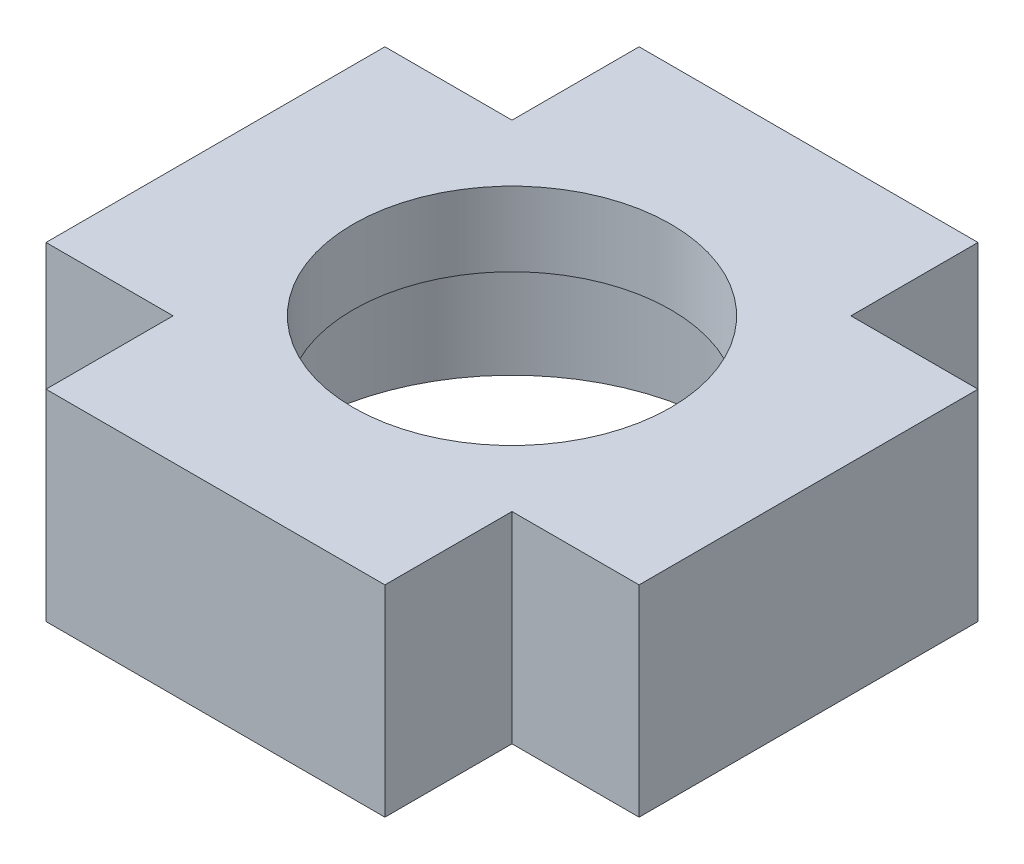
ISO-10303-21;
HEADER;
FILE_DESCRIPTION(('STEP AP214'),'2;1');
FILE_NAME('part.step','',(''),(''),'','','');
FILE_SCHEMA(('AUTOMOTIVE_DESIGN { 1 0 10303 214 1 1 1 1 }'));
ENDSEC;
DATA;
#1=APPLICATION_CONTEXT('core data for automotive mechanical design processes');
#2=APPLICATION_PROTOCOL_DEFINITION('international standard','automotive_design',2000,#1);
#3=PRODUCT_CONTEXT('',#1,'mechanical');
#4=PRODUCT('Part','Part','',(#3));
#5=PRODUCT_RELATED_PRODUCT_CATEGORY('part','',(#4));
#6=PRODUCT_DEFINITION_FORMATION('','',#4);
#7=PRODUCT_DEFINITION_CONTEXT('part definition',#1,'design');
#8=PRODUCT_DEFINITION('design','',#6,#7);
#9=PRODUCT_DEFINITION_SHAPE('','',#8);
#10=(LENGTH_UNIT() NAMED_UNIT(*) SI_UNIT(.MILLI.,.METRE.));
#11=(NAMED_UNIT(*) PLANE_ANGLE_UNIT() SI_UNIT($,.RADIAN.));
#12=(NAMED_UNIT(*) SI_UNIT($,.STERADIAN.) SOLID_ANGLE_UNIT());
#13=UNCERTAINTY_MEASURE_WITH_UNIT(LENGTH_MEASURE(1.E-05),#10,'distance_accuracy_value','');
#14=(GEOMETRIC_REPRESENTATION_CONTEXT(3) GLOBAL_UNCERTAINTY_ASSIGNED_CONTEXT((#13)) GLOBAL_UNIT_ASSIGNED_CONTEXT((#10,
#11,#12)) REPRESENTATION_CONTEXT('',''));
#15=CARTESIAN_POINT('',(0.,0.,0.));
#16=DIRECTION('',(0.,0.,1.));
#17=DIRECTION('',(1.,0.,0.));
#18=AXIS2_PLACEMENT_3D('',#15,#16,#17);
#19=CARTESIAN_POINT('',(0.,9.5,0.));
#20=DIRECTION('',(0.,-1.,0.));
#21=DIRECTION('',(0.,0.,-1.));
#22=AXIS2_PLACEMENT_3D('',#19,#20,#21);
#23=CYLINDRICAL_SURFACE('',#22,7.5);
#24=CARTESIAN_POINT('',(0.,9.5,0.));
#25=DIRECTION('',(0.,1.,0.));
#26=DIRECTION('',(0.,0.,1.));
#27=AXIS2_PLACEMENT_3D('',#24,#25,#26);
#28=CIRCLE('',#27,7.5);
#29=CARTESIAN_POINT('',(0.,9.5,7.5));
#30=VERTEX_POINT('',#29);
#31=EDGE_CURVE('E163',#30,#30,#28,.T.);
#32=ORIENTED_EDGE('',*,*,#31,.T.);
#33=EDGE_LOOP('',(#32));
#34=FACE_BOUND('',#33,.T.);
#35=CARTESIAN_POINT('',(0.,6.,0.));
#36=DIRECTION('',(0.,-1.,0.));
#37=DIRECTION('',(0.,0.,-1.));
#38=AXIS2_PLACEMENT_3D('',#35,#36,#37);
#39=CIRCLE('',#38,7.5);
#40=CARTESIAN_POINT('',(0.,6.,-7.5));
#41=VERTEX_POINT('',#40);
#42=EDGE_CURVE('E40',#41,#41,#39,.T.);
#43=ORIENTED_EDGE('',*,*,#42,.T.);
#44=EDGE_LOOP('',(#43));
#45=FACE_BOUND('',#44,.T.);
#46=ADVANCED_FACE('F36',(#34,#45),#23,.F.);
#47=CARTESIAN_POINT('',(0.,9.5,0.));
#48=DIRECTION('',(0.,-1.,0.));
#49=DIRECTION('',(0.,0.,-1.));
#50=AXIS2_PLACEMENT_3D('',#47,#48,#49);
#51=PLANE('',#50);
#52=DIRECTION('',(0.,0.,1.));
#53=VECTOR('',#52,1.);
#54=CARTESIAN_POINT('',(-8.00000000000001,9.5,-8.));
#55=LINE('',#54,#53);
#56=CARTESIAN_POINT('',(-8.00000000000001,9.5,-14.));
#57=VERTEX_POINT('',#56);
#58=CARTESIAN_POINT('',(-8.00000000000001,9.5,-8.));
#59=VERTEX_POINT('',#58);
#60=EDGE_CURVE('E182',#57,#59,#55,.T.);
#61=ORIENTED_EDGE('',*,*,#60,.T.);
#62=DIRECTION('',(-1.,0.,0.));
#63=VECTOR('',#62,1.);
#64=CARTESIAN_POINT('',(-14.,9.5,-8.));
#65=LINE('',#64,#63);
#66=CARTESIAN_POINT('',(-14.,9.5,-8.));
#67=VERTEX_POINT('',#66);
#68=EDGE_CURVE('E109',#59,#67,#65,.T.);
#69=ORIENTED_EDGE('',*,*,#68,.T.);
#70=DIRECTION('',(0.,0.,1.));
#71=VECTOR('',#70,1.);
#72=CARTESIAN_POINT('',(-14.,9.5,8.));
#73=LINE('',#72,#71);
#74=CARTESIAN_POINT('',(-14.,9.5,8.));
#75=VERTEX_POINT('',#74);
#76=EDGE_CURVE('E210',#67,#75,#73,.T.);
#77=ORIENTED_EDGE('',*,*,#76,.T.);
#78=DIRECTION('',(1.,0.,0.));
#79=VECTOR('',#78,1.);
#80=CARTESIAN_POINT('',(-8.,9.5,8.00000000000001));
#81=LINE('',#80,#79);
#82=CARTESIAN_POINT('',(-8.,9.5,8.00000000000001));
#83=VERTEX_POINT('',#82);
#84=EDGE_CURVE('E228',#75,#83,#81,.T.);
#85=ORIENTED_EDGE('',*,*,#84,.T.);
#86=DIRECTION('',(0.,0.,1.));
#87=VECTOR('',#86,1.);
#88=CARTESIAN_POINT('',(-8.,9.5,14.));
#89=LINE('',#88,#87);
#90=CARTESIAN_POINT('',(-8.,9.5,14.));
#91=VERTEX_POINT('',#90);
#92=EDGE_CURVE('E225',#83,#91,#89,.T.);
#93=ORIENTED_EDGE('',*,*,#92,.T.);
#94=DIRECTION('',(1.,0.,0.));
#95=VECTOR('',#94,1.);
#96=CARTESIAN_POINT('',(8.00000000000001,9.5,14.));
#97=LINE('',#96,#95);
#98=CARTESIAN_POINT('',(8.00000000000001,9.5,14.));
#99=VERTEX_POINT('',#98);
#100=EDGE_CURVE('E227',#91,#99,#97,.T.);
#101=ORIENTED_EDGE('',*,*,#100,.T.);
#102=DIRECTION('',(0.,0.,-1.));
#103=VECTOR('',#102,1.);
#104=CARTESIAN_POINT('',(8.,9.5,8.));
#105=LINE('',#104,#103);
#106=CARTESIAN_POINT('',(8.,9.5,8.));
#107=VERTEX_POINT('',#106);
#108=EDGE_CURVE('E230',#99,#107,#105,.T.);
#109=ORIENTED_EDGE('',*,*,#108,.T.);
#110=DIRECTION('',(1.,0.,0.));
#111=VECTOR('',#110,1.);
#112=CARTESIAN_POINT('',(14.,9.5,8.));
#113=LINE('',#112,#111);
#114=CARTESIAN_POINT('',(14.,9.5,8.));
#115=VERTEX_POINT('',#114);
#116=EDGE_CURVE('E236',#107,#115,#113,.T.);
#117=ORIENTED_EDGE('',*,*,#116,.T.);
#118=DIRECTION('',(0.,0.,-1.));
#119=VECTOR('',#118,1.);
#120=CARTESIAN_POINT('',(14.,9.5,-8.));
#121=LINE('',#120,#119);
#122=CARTESIAN_POINT('',(14.,9.5,-8.));
#123=VERTEX_POINT('',#122);
#124=EDGE_CURVE('E141',#115,#123,#121,.T.);
#125=ORIENTED_EDGE('',*,*,#124,.T.);
#126=DIRECTION('',(-1.,0.,0.));
#127=VECTOR('',#126,1.);
#128=CARTESIAN_POINT('',(8.00000000000001,9.5,-8.));
#129=LINE('',#128,#127);
#130=CARTESIAN_POINT('',(8.00000000000001,9.5,-8.));
#131=VERTEX_POINT('',#130);
#132=EDGE_CURVE('E134',#123,#131,#129,.T.);
#133=ORIENTED_EDGE('',*,*,#132,.T.);
#134=DIRECTION('',(0.,0.,-1.));
#135=VECTOR('',#134,1.);
#136=CARTESIAN_POINT('',(8.,9.5,-14.));
#137=LINE('',#136,#135);
#138=CARTESIAN_POINT('',(8.,9.5,-14.));
#139=VERTEX_POINT('',#138);
#140=EDGE_CURVE('E139',#131,#139,#137,.T.);
#141=ORIENTED_EDGE('',*,*,#140,.T.);
#142=DIRECTION('',(-1.,0.,0.));
#143=VECTOR('',#142,1.);
#144=CARTESIAN_POINT('',(-8.00000000000001,9.5,-14.));
#145=LINE('',#144,#143);
#146=EDGE_CURVE('E54',#139,#57,#145,.T.);
#147=ORIENTED_EDGE('',*,*,#146,.T.);
#148=EDGE_LOOP('',(#61,#69,#77,#85,#93,#101,#109,#117,#125,#133,#141,#147));
#149=FACE_BOUND('',#148,.T.);
#150=ORIENTED_EDGE('',*,*,#31,.F.);
#151=EDGE_LOOP('',(#150));
#152=FACE_BOUND('',#151,.T.);
#153=ADVANCED_FACE('F136',(#149,#152),#51,.F.);
#154=CARTESIAN_POINT('',(0.,0.,0.));
#155=DIRECTION('',(0.,-1.,0.));
#156=DIRECTION('',(0.,0.,-1.));
#157=AXIS2_PLACEMENT_3D('',#154,#155,#156);
#158=PLANE('',#157);
#159=CARTESIAN_POINT('',(0.,0.,0.));
#160=DIRECTION('',(0.,-1.,0.));
#161=DIRECTION('',(0.,0.,-1.));
#162=AXIS2_PLACEMENT_3D('',#159,#160,#161);
#163=CIRCLE('',#162,10.);
#164=CARTESIAN_POINT('',(0.,0.,-10.));
#165=VERTEX_POINT('',#164);
#166=EDGE_CURVE('E281',#165,#165,#163,.T.);
#167=ORIENTED_EDGE('',*,*,#166,.F.);
#168=EDGE_LOOP('',(#167));
#169=FACE_BOUND('',#168,.T.);
#170=DIRECTION('',(0.,0.,1.));
#171=VECTOR('',#170,1.);
#172=CARTESIAN_POINT('',(-8.00000000000001,0.,-8.));
#173=LINE('',#172,#171);
#174=CARTESIAN_POINT('',(-8.00000000000001,0.,-14.));
#175=VERTEX_POINT('',#174);
#176=CARTESIAN_POINT('',(-8.00000000000001,0.,-8.));
#177=VERTEX_POINT('',#176);
#178=EDGE_CURVE('E159',#175,#177,#173,.T.);
#179=ORIENTED_EDGE('',*,*,#178,.F.);
#180=DIRECTION('',(-1.,0.,0.));
#181=VECTOR('',#180,1.);
#182=CARTESIAN_POINT('',(-8.00000000000001,0.,-14.));
#183=LINE('',#182,#181);
#184=CARTESIAN_POINT('',(8.,0.,-14.));
#185=VERTEX_POINT('',#184);
#186=EDGE_CURVE('E101',#185,#175,#183,.T.);
#187=ORIENTED_EDGE('',*,*,#186,.F.);
#188=DIRECTION('',(0.,0.,-1.));
#189=VECTOR('',#188,1.);
#190=CARTESIAN_POINT('',(8.,0.,-14.));
#191=LINE('',#190,#189);
#192=CARTESIAN_POINT('',(8.00000000000001,0.,-8.));
#193=VERTEX_POINT('',#192);
#194=EDGE_CURVE('E95',#193,#185,#191,.T.);
#195=ORIENTED_EDGE('',*,*,#194,.F.);
#196=DIRECTION('',(-1.,0.,0.));
#197=VECTOR('',#196,1.);
#198=CARTESIAN_POINT('',(8.00000000000001,0.,-8.));
#199=LINE('',#198,#197);
#200=CARTESIAN_POINT('',(14.,0.,-8.));
#201=VERTEX_POINT('',#200);
#202=EDGE_CURVE('E149',#201,#193,#199,.T.);
#203=ORIENTED_EDGE('',*,*,#202,.F.);
#204=DIRECTION('',(0.,0.,-1.));
#205=VECTOR('',#204,1.);
#206=CARTESIAN_POINT('',(14.,0.,-8.));
#207=LINE('',#206,#205);
#208=CARTESIAN_POINT('',(14.,0.,8.));
#209=VERTEX_POINT('',#208);
#210=EDGE_CURVE('E177',#209,#201,#207,.T.);
#211=ORIENTED_EDGE('',*,*,#210,.F.);
#212=DIRECTION('',(1.,0.,0.));
#213=VECTOR('',#212,1.);
#214=CARTESIAN_POINT('',(14.,0.,8.));
#215=LINE('',#214,#213);
#216=CARTESIAN_POINT('',(8.,0.,8.));
#217=VERTEX_POINT('',#216);
#218=EDGE_CURVE('E175',#217,#209,#215,.T.);
#219=ORIENTED_EDGE('',*,*,#218,.F.);
#220=DIRECTION('',(0.,0.,-1.));
#221=VECTOR('',#220,1.);
#222=CARTESIAN_POINT('',(8.,0.,8.));
#223=LINE('',#222,#221);
#224=CARTESIAN_POINT('',(8.00000000000001,0.,14.));
#225=VERTEX_POINT('',#224);
#226=EDGE_CURVE('E173',#225,#217,#223,.T.);
#227=ORIENTED_EDGE('',*,*,#226,.F.);
#228=DIRECTION('',(1.,0.,0.));
#229=VECTOR('',#228,1.);
#230=CARTESIAN_POINT('',(8.00000000000001,0.,14.));
#231=LINE('',#230,#229);
#232=CARTESIAN_POINT('',(-8.,0.,14.));
#233=VERTEX_POINT('',#232);
#234=EDGE_CURVE('E171',#233,#225,#231,.T.);
#235=ORIENTED_EDGE('',*,*,#234,.F.);
#236=DIRECTION('',(0.,0.,1.));
#237=VECTOR('',#236,1.);
#238=CARTESIAN_POINT('',(-8.,0.,14.));
#239=LINE('',#238,#237);
#240=CARTESIAN_POINT('',(-8.,0.,8.00000000000001));
#241=VERTEX_POINT('',#240);
#242=EDGE_CURVE('E169',#241,#233,#239,.T.);
#243=ORIENTED_EDGE('',*,*,#242,.F.);
#244=DIRECTION('',(1.,0.,0.));
#245=VECTOR('',#244,1.);
#246=CARTESIAN_POINT('',(-8.,0.,8.00000000000001));
#247=LINE('',#246,#245);
#248=CARTESIAN_POINT('',(-14.,0.,8.));
#249=VERTEX_POINT('',#248);
#250=EDGE_CURVE('E167',#249,#241,#247,.T.);
#251=ORIENTED_EDGE('',*,*,#250,.F.);
#252=DIRECTION('',(0.,0.,1.));
#253=VECTOR('',#252,1.);
#254=CARTESIAN_POINT('',(-14.,0.,8.));
#255=LINE('',#254,#253);
#256=CARTESIAN_POINT('',(-14.,0.,-8.));
#257=VERTEX_POINT('',#256);
#258=EDGE_CURVE('E165',#257,#249,#255,.T.);
#259=ORIENTED_EDGE('',*,*,#258,.F.);
#260=DIRECTION('',(-1.,0.,0.));
#261=VECTOR('',#260,1.);
#262=CARTESIAN_POINT('',(-14.,0.,-8.));
#263=LINE('',#262,#261);
#264=EDGE_CURVE('E162',#177,#257,#263,.T.);
#265=ORIENTED_EDGE('',*,*,#264,.F.);
#266=EDGE_LOOP('',(#179,#187,#195,#203,#211,#219,#227,#235,#243,#251,#259,#265));
#267=FACE_BOUND('',#266,.T.);
#268=ADVANCED_FACE('F214',(#169,#267),#158,.T.);
#269=CARTESIAN_POINT('',(-8.00000000000001,9.5,-8.));
#270=DIRECTION('',(1.,0.,0.));
#271=DIRECTION('',(0.,0.,-1.));
#272=AXIS2_PLACEMENT_3D('',#269,#270,#271);
#273=PLANE('',#272);
#274=ORIENTED_EDGE('',*,*,#178,.T.);
#275=DIRECTION('',(0.,-1.,0.));
#276=VECTOR('',#275,1.);
#277=CARTESIAN_POINT('',(-8.00000000000001,9.5,-8.));
#278=LINE('',#277,#276);
#279=EDGE_CURVE('E11',#59,#177,#278,.T.);
#280=ORIENTED_EDGE('',*,*,#279,.F.);
#281=ORIENTED_EDGE('',*,*,#60,.F.);
#282=DIRECTION('',(0.,-1.,0.));
#283=VECTOR('',#282,1.);
#284=CARTESIAN_POINT('',(-8.00000000000001,9.5,-14.));
#285=LINE('',#284,#283);
#286=EDGE_CURVE('E155',#57,#175,#285,.T.);
#287=ORIENTED_EDGE('',*,*,#286,.T.);
#288=EDGE_LOOP('',(#274,#280,#281,#287));
#289=FACE_BOUND('',#288,.T.);
#290=ADVANCED_FACE('F38',(#289),#273,.F.);
#291=CARTESIAN_POINT('',(-14.,9.5,-8.));
#292=DIRECTION('',(0.,0.,1.));
#293=DIRECTION('',(1.,0.,0.));
#294=AXIS2_PLACEMENT_3D('',#291,#292,#293);
#295=PLANE('',#294);
#296=ORIENTED_EDGE('',*,*,#264,.T.);
#297=DIRECTION('',(0.,-1.,0.));
#298=VECTOR('',#297,1.);
#299=CARTESIAN_POINT('',(-14.,9.5,-8.));
#300=LINE('',#299,#298);
#301=EDGE_CURVE('E46',#67,#257,#300,.T.);
#302=ORIENTED_EDGE('',*,*,#301,.F.);
#303=ORIENTED_EDGE('',*,*,#68,.F.);
#304=ORIENTED_EDGE('',*,*,#279,.T.);
#305=EDGE_LOOP('',(#296,#302,#303,#304));
#306=FACE_BOUND('',#305,.T.);
#307=ADVANCED_FACE('F278',(#306),#295,.F.);
#308=CARTESIAN_POINT('',(-14.,9.5,8.));
#309=DIRECTION('',(1.,0.,0.));
#310=DIRECTION('',(0.,0.,-1.));
#311=AXIS2_PLACEMENT_3D('',#308,#309,#310);
#312=PLANE('',#311);
#313=ORIENTED_EDGE('',*,*,#258,.T.);
#314=DIRECTION('',(0.,-1.,0.));
#315=VECTOR('',#314,1.);
#316=CARTESIAN_POINT('',(-14.,9.5,8.));
#317=LINE('',#316,#315);
#318=EDGE_CURVE('E201',#75,#249,#317,.T.);
#319=ORIENTED_EDGE('',*,*,#318,.F.);
#320=ORIENTED_EDGE('',*,*,#76,.F.);
#321=ORIENTED_EDGE('',*,*,#301,.T.);
#322=EDGE_LOOP('',(#313,#319,#320,#321));
#323=FACE_BOUND('',#322,.T.);
#324=ADVANCED_FACE('F208',(#323),#312,.F.);
#325=CARTESIAN_POINT('',(-8.,9.5,8.00000000000001));
#326=DIRECTION('',(0.,0.,-1.));
#327=DIRECTION('',(-1.,0.,0.));
#328=AXIS2_PLACEMENT_3D('',#325,#326,#327);
#329=PLANE('',#328);
#330=ORIENTED_EDGE('',*,*,#250,.T.);
#331=DIRECTION('',(0.,-1.,0.));
#332=VECTOR('',#331,1.);
#333=CARTESIAN_POINT('',(-8.,9.5,8.00000000000001));
#334=LINE('',#333,#332);
#335=EDGE_CURVE('E198',#83,#241,#334,.T.);
#336=ORIENTED_EDGE('',*,*,#335,.F.);
#337=ORIENTED_EDGE('',*,*,#84,.F.);
#338=ORIENTED_EDGE('',*,*,#318,.T.);
#339=EDGE_LOOP('',(#330,#336,#337,#338));
#340=FACE_BOUND('',#339,.T.);
#341=ADVANCED_FACE('F219',(#340),#329,.F.);
#342=CARTESIAN_POINT('',(-8.,9.5,14.));
#343=DIRECTION('',(1.,0.,0.));
#344=DIRECTION('',(0.,0.,-1.));
#345=AXIS2_PLACEMENT_3D('',#342,#343,#344);
#346=PLANE('',#345);
#347=ORIENTED_EDGE('',*,*,#242,.T.);
#348=DIRECTION('',(0.,-1.,0.));
#349=VECTOR('',#348,1.);
#350=CARTESIAN_POINT('',(-8.,9.5,14.));
#351=LINE('',#350,#349);
#352=EDGE_CURVE('E195',#91,#233,#351,.T.);
#353=ORIENTED_EDGE('',*,*,#352,.F.);
#354=ORIENTED_EDGE('',*,*,#92,.F.);
#355=ORIENTED_EDGE('',*,*,#335,.T.);
#356=EDGE_LOOP('',(#347,#353,#354,#355));
#357=FACE_BOUND('',#356,.T.);
#358=ADVANCED_FACE('F223',(#357),#346,.F.);
#359=CARTESIAN_POINT('',(8.00000000000001,9.5,14.));
#360=DIRECTION('',(0.,0.,-1.));
#361=DIRECTION('',(-1.,0.,0.));
#362=AXIS2_PLACEMENT_3D('',#359,#360,#361);
#363=PLANE('',#362);
#364=ORIENTED_EDGE('',*,*,#234,.T.);
#365=DIRECTION('',(0.,-1.,0.));
#366=VECTOR('',#365,1.);
#367=CARTESIAN_POINT('',(8.00000000000001,9.5,14.));
#368=LINE('',#367,#366);
#369=EDGE_CURVE('E192',#99,#225,#368,.T.);
#370=ORIENTED_EDGE('',*,*,#369,.F.);
#371=ORIENTED_EDGE('',*,*,#100,.F.);
#372=ORIENTED_EDGE('',*,*,#352,.T.);
#373=EDGE_LOOP('',(#364,#370,#371,#372));
#374=FACE_BOUND('',#373,.T.);
#375=ADVANCED_FACE('F357',(#374),#363,.F.);
#376=CARTESIAN_POINT('',(8.,9.5,8.));
#377=DIRECTION('',(-1.,0.,0.));
#378=DIRECTION('',(0.,0.,1.));
#379=AXIS2_PLACEMENT_3D('',#376,#377,#378);
#380=PLANE('',#379);
#381=ORIENTED_EDGE('',*,*,#226,.T.);
#382=DIRECTION('',(0.,-1.,0.));
#383=VECTOR('',#382,1.);
#384=CARTESIAN_POINT('',(8.,9.5,8.));
#385=LINE('',#384,#383);
#386=EDGE_CURVE('E189',#107,#217,#385,.T.);
#387=ORIENTED_EDGE('',*,*,#386,.F.);
#388=ORIENTED_EDGE('',*,*,#108,.F.);
#389=ORIENTED_EDGE('',*,*,#369,.T.);
#390=EDGE_LOOP('',(#381,#387,#388,#389));
#391=FACE_BOUND('',#390,.T.);
#392=ADVANCED_FACE('F348',(#391),#380,.F.);
#393=CARTESIAN_POINT('',(14.,9.5,8.));
#394=DIRECTION('',(0.,0.,-1.));
#395=DIRECTION('',(-1.,0.,0.));
#396=AXIS2_PLACEMENT_3D('',#393,#394,#395);
#397=PLANE('',#396);
#398=ORIENTED_EDGE('',*,*,#218,.T.);
#399=DIRECTION('',(0.,-1.,0.));
#400=VECTOR('',#399,1.);
#401=CARTESIAN_POINT('',(14.,9.5,8.));
#402=LINE('',#401,#400);
#403=EDGE_CURVE('E186',#115,#209,#402,.T.);
#404=ORIENTED_EDGE('',*,*,#403,.F.);
#405=ORIENTED_EDGE('',*,*,#116,.F.);
#406=ORIENTED_EDGE('',*,*,#386,.T.);
#407=EDGE_LOOP('',(#398,#404,#405,#406));
#408=FACE_BOUND('',#407,.T.);
#409=ADVANCED_FACE('F242',(#408),#397,.F.);
#410=CARTESIAN_POINT('',(14.,9.5,-8.));
#411=DIRECTION('',(-1.,0.,0.));
#412=DIRECTION('',(0.,0.,1.));
#413=AXIS2_PLACEMENT_3D('',#410,#411,#412);
#414=PLANE('',#413);
#415=ORIENTED_EDGE('',*,*,#210,.T.);
#416=DIRECTION('',(0.,-1.,0.));
#417=VECTOR('',#416,1.);
#418=CARTESIAN_POINT('',(14.,9.5,-8.));
#419=LINE('',#418,#417);
#420=EDGE_CURVE('E150',#123,#201,#419,.T.);
#421=ORIENTED_EDGE('',*,*,#420,.F.);
#422=ORIENTED_EDGE('',*,*,#124,.F.);
#423=ORIENTED_EDGE('',*,*,#403,.T.);
#424=EDGE_LOOP('',(#415,#421,#422,#423));
#425=FACE_BOUND('',#424,.T.);
#426=ADVANCED_FACE('F246',(#425),#414,.F.);
#427=CARTESIAN_POINT('',(8.00000000000001,9.5,-8.));
#428=DIRECTION('',(0.,0.,1.));
#429=DIRECTION('',(1.,0.,0.));
#430=AXIS2_PLACEMENT_3D('',#427,#428,#429);
#431=PLANE('',#430);
#432=ORIENTED_EDGE('',*,*,#202,.T.);
#433=DIRECTION('',(0.,-1.,0.));
#434=VECTOR('',#433,1.);
#435=CARTESIAN_POINT('',(8.00000000000001,9.5,-8.));
#436=LINE('',#435,#434);
#437=EDGE_CURVE('E146',#131,#193,#436,.T.);
#438=ORIENTED_EDGE('',*,*,#437,.F.);
#439=ORIENTED_EDGE('',*,*,#132,.F.);
#440=ORIENTED_EDGE('',*,*,#420,.T.);
#441=EDGE_LOOP('',(#432,#438,#439,#440));
#442=FACE_BOUND('',#441,.T.);
#443=ADVANCED_FACE('F147',(#442),#431,.F.);
#444=CARTESIAN_POINT('',(8.,9.5,-14.));
#445=DIRECTION('',(-1.,0.,0.));
#446=DIRECTION('',(0.,0.,1.));
#447=AXIS2_PLACEMENT_3D('',#444,#445,#446);
#448=PLANE('',#447);
#449=ORIENTED_EDGE('',*,*,#194,.T.);
#450=DIRECTION('',(0.,-1.,0.));
#451=VECTOR('',#450,1.);
#452=CARTESIAN_POINT('',(8.,9.5,-14.));
#453=LINE('',#452,#451);
#454=EDGE_CURVE('E151',#139,#185,#453,.T.);
#455=ORIENTED_EDGE('',*,*,#454,.F.);
#456=ORIENTED_EDGE('',*,*,#140,.F.);
#457=ORIENTED_EDGE('',*,*,#437,.T.);
#458=EDGE_LOOP('',(#449,#455,#456,#457));
#459=FACE_BOUND('',#458,.T.);
#460=ADVANCED_FACE('F153',(#459),#448,.F.);
#461=CARTESIAN_POINT('',(-8.00000000000001,9.5,-14.));
#462=DIRECTION('',(0.,0.,1.));
#463=DIRECTION('',(1.,0.,0.));
#464=AXIS2_PLACEMENT_3D('',#461,#462,#463);
#465=PLANE('',#464);
#466=ORIENTED_EDGE('',*,*,#186,.T.);
#467=ORIENTED_EDGE('',*,*,#286,.F.);
#468=ORIENTED_EDGE('',*,*,#146,.F.);
#469=ORIENTED_EDGE('',*,*,#454,.T.);
#470=EDGE_LOOP('',(#466,#467,#468,#469));
#471=FACE_BOUND('',#470,.T.);
#472=ADVANCED_FACE('F250',(#471),#465,.F.);
#473=CARTESIAN_POINT('',(0.,6.,0.));
#474=DIRECTION('',(0.,-1.,0.));
#475=DIRECTION('',(0.,0.,-1.));
#476=AXIS2_PLACEMENT_3D('',#473,#474,#475);
#477=CYLINDRICAL_SURFACE('',#476,10.);
#478=CARTESIAN_POINT('',(0.,6.,0.));
#479=DIRECTION('',(0.,-1.,0.));
#480=DIRECTION('',(0.,0.,-1.));
#481=AXIS2_PLACEMENT_3D('',#478,#479,#480);
#482=CIRCLE('',#481,10.);
#483=CARTESIAN_POINT('',(0.,6.,-10.));
#484=VERTEX_POINT('',#483);
#485=EDGE_CURVE('E283',#484,#484,#482,.T.);
#486=ORIENTED_EDGE('',*,*,#485,.F.);
#487=EDGE_LOOP('',(#486));
#488=FACE_BOUND('',#487,.T.);
#489=ORIENTED_EDGE('',*,*,#166,.T.);
#490=EDGE_LOOP('',(#489));
#491=FACE_BOUND('',#490,.T.);
#492=ADVANCED_FACE('F252',(#488,#491),#477,.F.);
#493=CARTESIAN_POINT('',(0.,6.,0.));
#494=DIRECTION('',(0.,-1.,0.));
#495=DIRECTION('',(0.,0.,-1.));
#496=AXIS2_PLACEMENT_3D('',#493,#494,#495);
#497=PLANE('',#496);
#498=ORIENTED_EDGE('',*,*,#42,.F.);
#499=EDGE_LOOP('',(#498));
#500=FACE_BOUND('',#499,.T.);
#501=ORIENTED_EDGE('',*,*,#485,.T.);
#502=EDGE_LOOP('',(#501));
#503=FACE_BOUND('',#502,.T.);
#504=ADVANCED_FACE('F258',(#500,#503),#497,.T.);
#505=CLOSED_SHELL('',(#46,#153,#268,#290,#307,#324,#341,#358,#375,#392,#409,#426,#443,#460,#472,
#492,#504));
#506=MANIFOLD_SOLID_BREP('B2',#505);
#507=ADVANCED_BREP_SHAPE_REPRESENTATION('',(#18,#506),#14);
#508=SHAPE_DEFINITION_REPRESENTATION(#9,#507);
ENDSEC;
END-ISO-10303-21;
